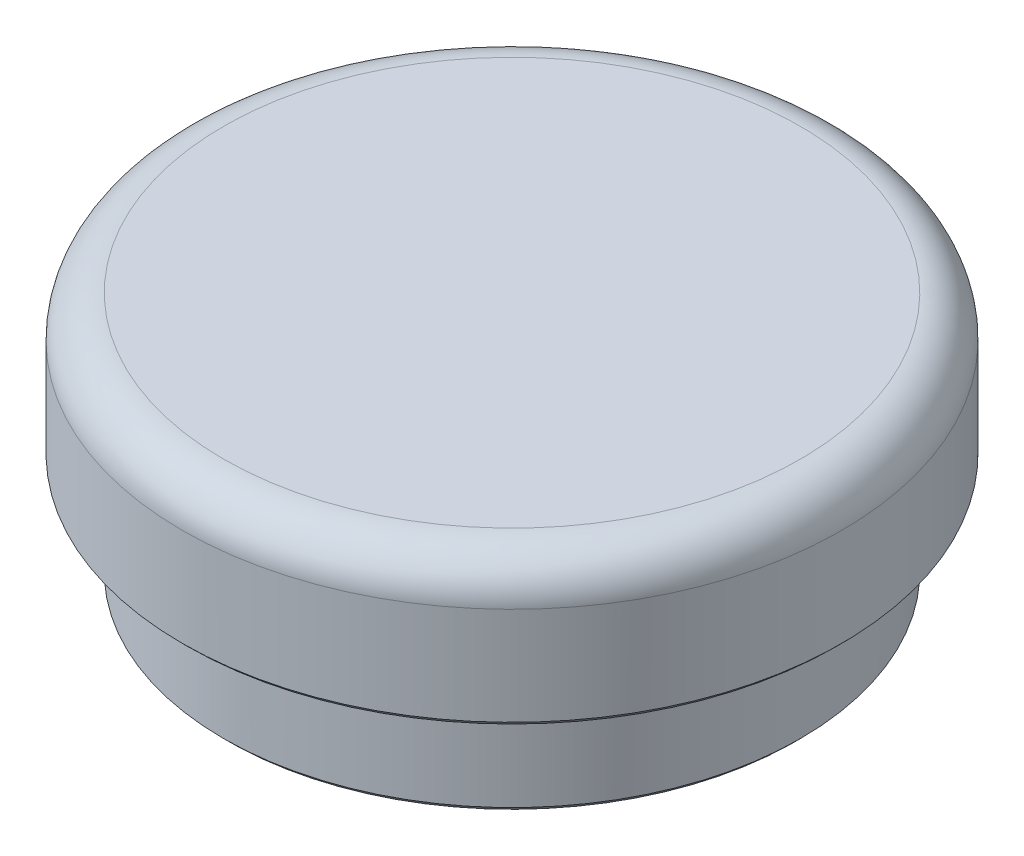
ISO-10303-21;
HEADER;
FILE_DESCRIPTION(('STEP AP214'),'2;1');
FILE_NAME('part.step','',(''),(''),'','','');
FILE_SCHEMA(('AUTOMOTIVE_DESIGN { 1 0 10303 214 1 1 1 1 }'));
ENDSEC;
DATA;
#1=APPLICATION_CONTEXT('core data for automotive mechanical design processes');
#2=APPLICATION_PROTOCOL_DEFINITION('international standard','automotive_design',2000,#1);
#3=PRODUCT_CONTEXT('',#1,'mechanical');
#4=PRODUCT('Part','Part','',(#3));
#5=PRODUCT_RELATED_PRODUCT_CATEGORY('part','',(#4));
#6=PRODUCT_DEFINITION_FORMATION('','',#4);
#7=PRODUCT_DEFINITION_CONTEXT('part definition',#1,'design');
#8=PRODUCT_DEFINITION('design','',#6,#7);
#9=PRODUCT_DEFINITION_SHAPE('','',#8);
#10=(LENGTH_UNIT() NAMED_UNIT(*) SI_UNIT(.MILLI.,.METRE.));
#11=(NAMED_UNIT(*) PLANE_ANGLE_UNIT() SI_UNIT($,.RADIAN.));
#12=(NAMED_UNIT(*) SI_UNIT($,.STERADIAN.) SOLID_ANGLE_UNIT());
#13=UNCERTAINTY_MEASURE_WITH_UNIT(LENGTH_MEASURE(1.E-05),#10,'distance_accuracy_value','');
#14=(GEOMETRIC_REPRESENTATION_CONTEXT(3) GLOBAL_UNCERTAINTY_ASSIGNED_CONTEXT((#13)) GLOBAL_UNIT_ASSIGNED_CONTEXT((#10,
#11,#12)) REPRESENTATION_CONTEXT('',''));
#15=CARTESIAN_POINT('',(0.,0.,0.));
#16=DIRECTION('',(0.,0.,1.));
#17=DIRECTION('',(1.,0.,0.));
#18=AXIS2_PLACEMENT_3D('',#15,#16,#17);
#19=CARTESIAN_POINT('',(0.,0.,0.));
#20=DIRECTION('',(0.,-1.,0.));
#21=DIRECTION('',(0.,0.,-1.));
#22=AXIS2_PLACEMENT_3D('',#19,#20,#21);
#23=PLANE('',#22);
#24=CARTESIAN_POINT('',(0.,0.,0.));
#25=DIRECTION('',(0.,-1.,0.));
#26=DIRECTION('',(0.,0.,-1.));
#27=AXIS2_PLACEMENT_3D('',#24,#25,#26);
#28=CIRCLE('',#27,10.25);
#29=CARTESIAN_POINT('',(0.,0.,-10.25));
#30=VERTEX_POINT('',#29);
#31=EDGE_CURVE('E46',#30,#30,#28,.F.);
#32=ORIENTED_EDGE('',*,*,#31,.T.);
#33=EDGE_LOOP('',(#32));
#34=FACE_BOUND('',#33,.T.);
#35=CARTESIAN_POINT('',(0.,0.,0.));
#36=DIRECTION('',(0.,-1.,0.));
#37=DIRECTION('',(0.,0.,-1.));
#38=AXIS2_PLACEMENT_3D('',#35,#36,#37);
#39=CIRCLE('',#38,13.75);
#40=CARTESIAN_POINT('',(0.,0.,-13.75));
#41=VERTEX_POINT('',#40);
#42=EDGE_CURVE('E51',#41,#41,#39,.T.);
#43=ORIENTED_EDGE('',*,*,#42,.T.);
#44=EDGE_LOOP('',(#43));
#45=FACE_BOUND('',#44,.T.);
#46=ADVANCED_FACE('F31',(#34,#45),#23,.T.);
#47=CARTESIAN_POINT('',(0.,12.,0.));
#48=DIRECTION('',(0.,1.,0.));
#49=DIRECTION('',(0.,0.,1.));
#50=AXIS2_PLACEMENT_3D('',#47,#48,#49);
#51=CYLINDRICAL_SURFACE('',#50,14.);
#52=CARTESIAN_POINT('',(0.,0.249999999999999,0.));
#53=DIRECTION('',(0.,-1.,0.));
#54=DIRECTION('',(0.,0.,-1.));
#55=AXIS2_PLACEMENT_3D('',#52,#53,#54);
#56=CIRCLE('',#55,14.);
#57=CARTESIAN_POINT('',(0.,0.249999999999999,-14.));
#58=VERTEX_POINT('',#57);
#59=EDGE_CURVE('E42',#58,#58,#56,.F.);
#60=ORIENTED_EDGE('',*,*,#59,.T.);
#61=EDGE_LOOP('',(#60));
#62=FACE_BOUND('',#61,.T.);
#63=CARTESIAN_POINT('',(0.,5.,0.));
#64=DIRECTION('',(0.,1.,0.));
#65=DIRECTION('',(0.,0.,1.));
#66=AXIS2_PLACEMENT_3D('',#63,#64,#65);
#67=CIRCLE('',#66,14.);
#68=CARTESIAN_POINT('',(0.,5.,14.));
#69=VERTEX_POINT('',#68);
#70=EDGE_CURVE('E63',#69,#69,#67,.T.);
#71=ORIENTED_EDGE('',*,*,#70,.F.);
#72=EDGE_LOOP('',(#71));
#73=FACE_BOUND('',#72,.T.);
#74=ADVANCED_FACE('F88',(#62,#73),#51,.T.);
#75=CARTESIAN_POINT('',(-14.,5.,0.));
#76=DIRECTION('',(0.,-1.,0.));
#77=DIRECTION('',(0.,0.,-1.));
#78=AXIS2_PLACEMENT_3D('',#75,#76,#77);
#79=PLANE('',#78);
#80=CARTESIAN_POINT('',(0.,5.,0.));
#81=DIRECTION('',(0.,-1.,0.));
#82=DIRECTION('',(0.,0.,-1.));
#83=AXIS2_PLACEMENT_3D('',#80,#81,#82);
#84=CIRCLE('',#83,15.75);
#85=CARTESIAN_POINT('',(0.,5.,-15.75));
#86=VERTEX_POINT('',#85);
#87=EDGE_CURVE('E10',#86,#86,#84,.T.);
#88=ORIENTED_EDGE('',*,*,#87,.T.);
#89=EDGE_LOOP('',(#88));
#90=FACE_BOUND('',#89,.T.);
#91=ORIENTED_EDGE('',*,*,#70,.T.);
#92=EDGE_LOOP('',(#91));
#93=FACE_BOUND('',#92,.T.);
#94=ADVANCED_FACE('F94',(#90,#93),#79,.T.);
#95=CARTESIAN_POINT('',(0.,12.,0.));
#96=DIRECTION('',(0.,1.,0.));
#97=DIRECTION('',(0.,0.,1.));
#98=AXIS2_PLACEMENT_3D('',#95,#96,#97);
#99=CYLINDRICAL_SURFACE('',#98,16.);
#100=CARTESIAN_POINT('',(0.,5.24999999999999,0.));
#101=DIRECTION('',(0.,-1.,0.));
#102=DIRECTION('',(0.,0.,-1.));
#103=AXIS2_PLACEMENT_3D('',#100,#101,#102);
#104=CIRCLE('',#103,16.);
#105=CARTESIAN_POINT('',(0.,5.24999999999999,-16.));
#106=VERTEX_POINT('',#105);
#107=EDGE_CURVE('E38',#106,#106,#104,.F.);
#108=ORIENTED_EDGE('',*,*,#107,.T.);
#109=EDGE_LOOP('',(#108));
#110=FACE_BOUND('',#109,.T.);
#111=CARTESIAN_POINT('',(0.,10.,0.));
#112=DIRECTION('',(0.,1.,0.));
#113=DIRECTION('',(0.,0.,1.));
#114=AXIS2_PLACEMENT_3D('',#111,#112,#113);
#115=CIRCLE('',#114,16.);
#116=CARTESIAN_POINT('',(0.,10.,16.));
#117=VERTEX_POINT('',#116);
#118=EDGE_CURVE('E57',#117,#117,#115,.F.);
#119=ORIENTED_EDGE('',*,*,#118,.T.);
#120=EDGE_LOOP('',(#119));
#121=FACE_BOUND('',#120,.T.);
#122=ADVANCED_FACE('F116',(#110,#121),#99,.T.);
#123=CARTESIAN_POINT('',(-16.,12.,0.));
#124=DIRECTION('',(0.,1.,0.));
#125=DIRECTION('',(0.,0.,1.));
#126=AXIS2_PLACEMENT_3D('',#123,#124,#125);
#127=PLANE('',#126);
#128=CARTESIAN_POINT('',(0.,12.,0.));
#129=DIRECTION('',(0.,1.,0.));
#130=DIRECTION('',(0.,0.,1.));
#131=AXIS2_PLACEMENT_3D('',#128,#129,#130);
#132=CIRCLE('',#131,14.);
#133=CARTESIAN_POINT('',(0.,12.,14.));
#134=VERTEX_POINT('',#133);
#135=EDGE_CURVE('E60',#134,#134,#132,.T.);
#136=ORIENTED_EDGE('',*,*,#135,.T.);
#137=EDGE_LOOP('',(#136));
#138=FACE_BOUND('',#137,.T.);
#139=ADVANCED_FACE('F83',(#138),#127,.T.);
#140=CARTESIAN_POINT('',(0.,10.,0.));
#141=DIRECTION('',(0.,1.,0.));
#142=DIRECTION('',(0.,0.,1.));
#143=AXIS2_PLACEMENT_3D('',#140,#141,#142);
#144=TOROIDAL_SURFACE('',#143,14.,2.);
#145=ORIENTED_EDGE('',*,*,#118,.F.);
#146=EDGE_LOOP('',(#145));
#147=FACE_BOUND('',#146,.T.);
#148=ORIENTED_EDGE('',*,*,#135,.F.);
#149=EDGE_LOOP('',(#148));
#150=FACE_BOUND('',#149,.T.);
#151=ADVANCED_FACE('F74',(#147,#150),#144,.T.);
#152=CARTESIAN_POINT('',(0.,9.,0.));
#153=DIRECTION('',(0.,-1.,0.));
#154=DIRECTION('',(0.,0.,-1.));
#155=AXIS2_PLACEMENT_3D('',#152,#153,#154);
#156=CYLINDRICAL_SURFACE('',#155,10.);
#157=CARTESIAN_POINT('',(0.,0.250000000000002,0.));
#158=DIRECTION('',(0.,-1.,0.));
#159=DIRECTION('',(0.,0.,-1.));
#160=AXIS2_PLACEMENT_3D('',#157,#158,#159);
#161=CIRCLE('',#160,10.);
#162=CARTESIAN_POINT('',(0.,0.250000000000002,-10.));
#163=VERTEX_POINT('',#162);
#164=EDGE_CURVE('E54',#163,#163,#161,.T.);
#165=ORIENTED_EDGE('',*,*,#164,.T.);
#166=EDGE_LOOP('',(#165));
#167=FACE_BOUND('',#166,.T.);
#168=CARTESIAN_POINT('',(0.,9.,0.));
#169=DIRECTION('',(0.,-1.,0.));
#170=DIRECTION('',(0.,0.,-1.));
#171=AXIS2_PLACEMENT_3D('',#168,#169,#170);
#172=CIRCLE('',#171,10.);
#173=CARTESIAN_POINT('',(0.,9.,-10.));
#174=VERTEX_POINT('',#173);
#175=EDGE_CURVE('E66',#174,#174,#172,.T.);
#176=ORIENTED_EDGE('',*,*,#175,.F.);
#177=EDGE_LOOP('',(#176));
#178=FACE_BOUND('',#177,.T.);
#179=ADVANCED_FACE('F72',(#167,#178),#156,.F.);
#180=CARTESIAN_POINT('',(0.,9.,0.));
#181=DIRECTION('',(0.,-1.,0.));
#182=DIRECTION('',(0.,0.,-1.));
#183=AXIS2_PLACEMENT_3D('',#180,#181,#182);
#184=PLANE('',#183);
#185=ORIENTED_EDGE('',*,*,#175,.T.);
#186=EDGE_LOOP('',(#185));
#187=FACE_BOUND('',#186,.T.);
#188=ADVANCED_FACE('F70',(#187),#184,.T.);
#189=CARTESIAN_POINT('',(0.,0.250000000000002,0.));
#190=DIRECTION('',(0.,-1.,0.));
#191=DIRECTION('',(0.,0.,-1.));
#192=AXIS2_PLACEMENT_3D('',#189,#190,#191);
#193=CONICAL_SURFACE('',#192,10.,0.785398163397448);
#194=ORIENTED_EDGE('',*,*,#31,.F.);
#195=EDGE_LOOP('',(#194));
#196=FACE_BOUND('',#195,.T.);
#197=ORIENTED_EDGE('',*,*,#164,.F.);
#198=EDGE_LOOP('',(#197));
#199=FACE_BOUND('',#198,.T.);
#200=ADVANCED_FACE('F81',(#196,#199),#193,.F.);
#201=CARTESIAN_POINT('',(0.,0.249999999999999,0.));
#202=DIRECTION('',(0.,1.,0.));
#203=DIRECTION('',(0.,0.,1.));
#204=AXIS2_PLACEMENT_3D('',#201,#202,#203);
#205=CONICAL_SURFACE('',#204,14.,0.785398163397455);
#206=ORIENTED_EDGE('',*,*,#42,.F.);
#207=EDGE_LOOP('',(#206));
#208=FACE_BOUND('',#207,.T.);
#209=ORIENTED_EDGE('',*,*,#59,.F.);
#210=EDGE_LOOP('',(#209));
#211=FACE_BOUND('',#210,.T.);
#212=ADVANCED_FACE('F101',(#208,#211),#205,.T.);
#213=CARTESIAN_POINT('',(0.,5.24999999999999,0.));
#214=DIRECTION('',(0.,1.,0.));
#215=DIRECTION('',(0.,0.,1.));
#216=AXIS2_PLACEMENT_3D('',#213,#214,#215);
#217=CONICAL_SURFACE('',#216,16.,0.785398163397462);
#218=ORIENTED_EDGE('',*,*,#87,.F.);
#219=EDGE_LOOP('',(#218));
#220=FACE_BOUND('',#219,.T.);
#221=ORIENTED_EDGE('',*,*,#107,.F.);
#222=EDGE_LOOP('',(#221));
#223=FACE_BOUND('',#222,.T.);
#224=ADVANCED_FACE('F33',(#220,#223),#217,.T.);
#225=CLOSED_SHELL('',(#46,#74,#94,#122,#139,#151,#179,#188,#200,#212,#224));
#226=MANIFOLD_SOLID_BREP('B2',#225);
#227=ADVANCED_BREP_SHAPE_REPRESENTATION('',(#18,#226),#14);
#228=SHAPE_DEFINITION_REPRESENTATION(#9,#227);
ENDSEC;
END-ISO-10303-21;
